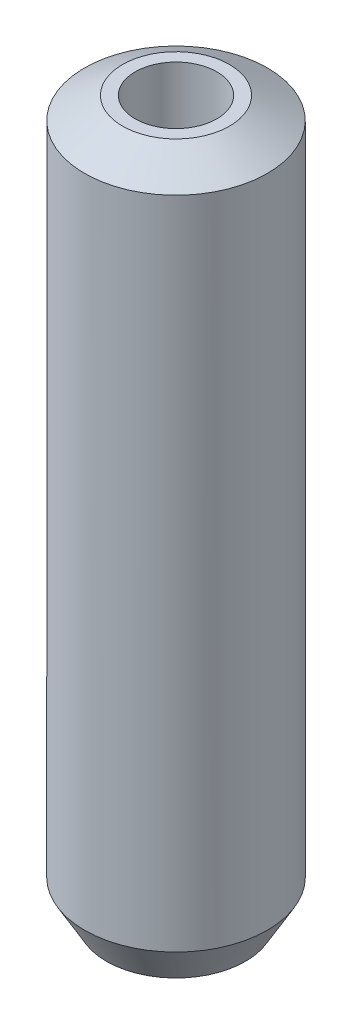
ISO-10303-21;
HEADER;
FILE_DESCRIPTION(('STEP AP214'),'2;1');
FILE_NAME('part.step','',(''),(''),'','','');
FILE_SCHEMA(('AUTOMOTIVE_DESIGN { 1 0 10303 214 1 1 1 1 }'));
ENDSEC;
DATA;
#1=APPLICATION_CONTEXT('core data for automotive mechanical design processes');
#2=APPLICATION_PROTOCOL_DEFINITION('international standard','automotive_design',2000,#1);
#3=PRODUCT_CONTEXT('',#1,'mechanical');
#4=PRODUCT('Part','Part','',(#3));
#5=PRODUCT_RELATED_PRODUCT_CATEGORY('part','',(#4));
#6=PRODUCT_DEFINITION_FORMATION('','',#4);
#7=PRODUCT_DEFINITION_CONTEXT('part definition',#1,'design');
#8=PRODUCT_DEFINITION('design','',#6,#7);
#9=PRODUCT_DEFINITION_SHAPE('','',#8);
#10=(LENGTH_UNIT() NAMED_UNIT(*) SI_UNIT(.MILLI.,.METRE.));
#11=(NAMED_UNIT(*) PLANE_ANGLE_UNIT() SI_UNIT($,.RADIAN.));
#12=(NAMED_UNIT(*) SI_UNIT($,.STERADIAN.) SOLID_ANGLE_UNIT());
#13=UNCERTAINTY_MEASURE_WITH_UNIT(LENGTH_MEASURE(1.E-05),#10,'distance_accuracy_value','');
#14=(GEOMETRIC_REPRESENTATION_CONTEXT(3) GLOBAL_UNCERTAINTY_ASSIGNED_CONTEXT((#13)) GLOBAL_UNIT_ASSIGNED_CONTEXT((#10,
#11,#12)) REPRESENTATION_CONTEXT('',''));
#15=CARTESIAN_POINT('',(0.,0.,0.));
#16=DIRECTION('',(0.,0.,1.));
#17=DIRECTION('',(1.,0.,0.));
#18=AXIS2_PLACEMENT_3D('',#15,#16,#17);
#19=CARTESIAN_POINT('',(0.,117.374975051236,0.));
#20=DIRECTION('',(0.,-1.,0.));
#21=DIRECTION('',(0.,0.,-1.));
#22=AXIS2_PLACEMENT_3D('',#19,#20,#21);
#23=CYLINDRICAL_SURFACE('',#22,15.);
#24=CARTESIAN_POINT('',(0.,113.778539409676,0.));
#25=DIRECTION('',(0.,1.,0.));
#26=DIRECTION('',(0.,0.,1.));
#27=AXIS2_PLACEMENT_3D('',#24,#25,#26);
#28=CIRCLE('',#27,15.);
#29=CARTESIAN_POINT('',(0.,113.778539409676,-15.));
#30=VERTEX_POINT('',#29);
#31=EDGE_CURVE('E50',#30,#30,#28,.F.);
#32=ORIENTED_EDGE('',*,*,#31,.T.);
#33=EDGE_LOOP('',(#32));
#34=FACE_BOUND('',#33,.T.);
#35=CARTESIAN_POINT('',(0.,6.22920925733446,0.));
#36=DIRECTION('',(0.,1.,0.));
#37=DIRECTION('',(0.,0.,1.));
#38=AXIS2_PLACEMENT_3D('',#35,#36,#37);
#39=CIRCLE('',#38,15.);
#40=CARTESIAN_POINT('',(0.,6.22920925733446,15.));
#41=VERTEX_POINT('',#40);
#42=EDGE_CURVE('E51',#41,#41,#39,.T.);
#43=ORIENTED_EDGE('',*,*,#42,.T.);
#44=EDGE_LOOP('',(#43));
#45=FACE_BOUND('',#44,.T.);
#46=ADVANCED_FACE('F39',(#34,#45),#23,.T.);
#47=CARTESIAN_POINT('',(0.,117.374975051236,0.));
#48=DIRECTION('',(0.,1.,0.));
#49=DIRECTION('',(0.,0.,1.));
#50=AXIS2_PLACEMENT_3D('',#47,#48,#49);
#51=PLANE('',#50);
#52=CARTESIAN_POINT('',(0.,117.374975051236,0.));
#53=DIRECTION('',(0.,1.,0.));
#54=DIRECTION('',(0.,0.,1.));
#55=AXIS2_PLACEMENT_3D('',#52,#53,#54);
#56=CIRCLE('',#55,8.77079074266558);
#57=CARTESIAN_POINT('',(0.,117.374975051236,-8.77079074266559));
#58=VERTEX_POINT('',#57);
#59=EDGE_CURVE('E54',#58,#58,#56,.T.);
#60=ORIENTED_EDGE('',*,*,#59,.T.);
#61=EDGE_LOOP('',(#60));
#62=FACE_BOUND('',#61,.T.);
#63=CARTESIAN_POINT('',(0.,117.374975051236,0.));
#64=DIRECTION('',(0.,1.,0.));
#65=DIRECTION('',(0.,0.,1.));
#66=AXIS2_PLACEMENT_3D('',#63,#64,#65);
#67=CIRCLE('',#66,6.69556431701158);
#68=CARTESIAN_POINT('',(0.,117.374975051236,6.69556431701158));
#69=VERTEX_POINT('',#68);
#70=EDGE_CURVE('E58',#69,#69,#67,.T.);
#71=ORIENTED_EDGE('',*,*,#70,.F.);
#72=EDGE_LOOP('',(#71));
#73=FACE_BOUND('',#72,.T.);
#74=ADVANCED_FACE('F69',(#62,#73),#51,.T.);
#75=CARTESIAN_POINT('',(0.,0.,0.));
#76=DIRECTION('',(0.,1.,0.));
#77=DIRECTION('',(0.,0.,1.));
#78=AXIS2_PLACEMENT_3D('',#75,#76,#77);
#79=PLANE('',#78);
#80=CARTESIAN_POINT('',(0.,0.,0.));
#81=DIRECTION('',(0.,1.,0.));
#82=DIRECTION('',(0.,0.,1.));
#83=AXIS2_PLACEMENT_3D('',#80,#81,#82);
#84=CIRCLE('',#83,11.4035643584394);
#85=CARTESIAN_POINT('',(0.,0.,11.4035643584394));
#86=VERTEX_POINT('',#85);
#87=EDGE_CURVE('E10',#86,#86,#84,.F.);
#88=ORIENTED_EDGE('',*,*,#87,.T.);
#89=EDGE_LOOP('',(#88));
#90=FACE_BOUND('',#89,.T.);
#91=CARTESIAN_POINT('',(0.,0.,0.));
#92=DIRECTION('',(0.,1.,0.));
#93=DIRECTION('',(0.,0.,1.));
#94=AXIS2_PLACEMENT_3D('',#91,#92,#93);
#95=CIRCLE('',#94,6.69556431701158);
#96=CARTESIAN_POINT('',(0.,0.,6.69556431701158));
#97=VERTEX_POINT('',#96);
#98=EDGE_CURVE('E63',#97,#97,#95,.T.);
#99=ORIENTED_EDGE('',*,*,#98,.T.);
#100=EDGE_LOOP('',(#99));
#101=FACE_BOUND('',#100,.T.);
#102=ADVANCED_FACE('F75',(#90,#101),#79,.F.);
#103=CARTESIAN_POINT('',(0.,117.374975051236,0.));
#104=DIRECTION('',(0.,-1.,0.));
#105=DIRECTION('',(0.,0.,-1.));
#106=AXIS2_PLACEMENT_3D('',#103,#104,#105);
#107=CYLINDRICAL_SURFACE('',#106,6.69556431701158);
#108=ORIENTED_EDGE('',*,*,#70,.T.);
#109=EDGE_LOOP('',(#108));
#110=FACE_BOUND('',#109,.T.);
#111=ORIENTED_EDGE('',*,*,#98,.F.);
#112=EDGE_LOOP('',(#111));
#113=FACE_BOUND('',#112,.T.);
#114=ADVANCED_FACE('F70',(#110,#113),#107,.F.);
#115=CARTESIAN_POINT('',(0.,117.374975051236,0.));
#116=DIRECTION('',(0.,-1.,0.));
#117=DIRECTION('',(0.,0.,-1.));
#118=AXIS2_PLACEMENT_3D('',#115,#116,#117);
#119=CONICAL_SURFACE('',#118,8.77079074266558,1.04719755119659);
#120=CARTESIAN_POINT('',(0.,113.778539409676,-15.));
#121=CARTESIAN_POINT('',(0.,113.816002280942,-14.9351124035694));
#122=CARTESIAN_POINT('',(0.,113.853465152208,-14.8702248071389));
#123=CARTESIAN_POINT('',(0.,113.928390894741,-14.7404496142777));
#124=CARTESIAN_POINT('',(0.,113.965853766007,-14.6755620178472));
#125=CARTESIAN_POINT('',(0.,114.04077950854,-14.545786824986));
#126=CARTESIAN_POINT('',(0.,114.078242379806,-14.4808992285555));
#127=CARTESIAN_POINT('',(0.,114.153168122338,-14.3511240356943));
#128=CARTESIAN_POINT('',(0.,114.190630993605,-14.2862364392638));
#129=CARTESIAN_POINT('',(0.,114.265556736137,-14.1564612464026));
#130=CARTESIAN_POINT('',(0.,114.303019607403,-14.0915736499721));
#131=CARTESIAN_POINT('',(0.,114.377945349936,-13.9617984571109));
#132=CARTESIAN_POINT('',(0.,114.415408221202,-13.8969108606804));
#133=CARTESIAN_POINT('',(0.,114.490333963735,-13.7671356678192));
#134=CARTESIAN_POINT('',(0.,114.527796835001,-13.7022480713887));
#135=CARTESIAN_POINT('',(0.,114.602722577534,-13.5724728785275));
#136=CARTESIAN_POINT('',(0.,114.6401854488,-13.507585282097));
#137=CARTESIAN_POINT('',(0.,114.715111191332,-13.3778100892358));
#138=CARTESIAN_POINT('',(0.,114.752574062599,-13.3129224928053));
#139=CARTESIAN_POINT('',(0.,114.827499805131,-13.1831472999441));
#140=CARTESIAN_POINT('',(0.,114.864962676397,-13.1182597035136));
#141=CARTESIAN_POINT('',(0.,114.93988841893,-12.9884845106524));
#142=CARTESIAN_POINT('',(0.,114.977351290196,-12.9235969142219));
#143=CARTESIAN_POINT('',(0.,115.052277032729,-12.7938217213607));
#144=CARTESIAN_POINT('',(0.,115.089739903995,-12.7289341249302));
#145=CARTESIAN_POINT('',(0.,115.164665646527,-12.599158932069));
#146=CARTESIAN_POINT('',(0.,115.202128517794,-12.5342713356385));
#147=CARTESIAN_POINT('',(0.,115.277054260326,-12.4044961427773));
#148=CARTESIAN_POINT('',(0.,115.314517131592,-12.3396085463468));
#149=CARTESIAN_POINT('',(0.,115.389442874125,-12.2098333534856));
#150=CARTESIAN_POINT('',(0.,115.426905745391,-12.1449457570551));
#151=CARTESIAN_POINT('',(0.,115.501831487924,-12.0151705641939));
#152=CARTESIAN_POINT('',(0.,115.53929435919,-11.9502829677634));
#153=CARTESIAN_POINT('',(0.,115.614220101722,-11.8205077749022));
#154=CARTESIAN_POINT('',(0.,115.651682972989,-11.7556201784717));
#155=CARTESIAN_POINT('',(0.,115.726608715521,-11.6258449856105));
#156=CARTESIAN_POINT('',(0.,115.764071586787,-11.56095738918));
#157=CARTESIAN_POINT('',(0.,115.83899732932,-11.4311821963188));
#158=CARTESIAN_POINT('',(0.,115.876460200586,-11.3662945998883));
#159=CARTESIAN_POINT('',(0.,115.951385943119,-11.2365194070271));
#160=CARTESIAN_POINT('',(0.,115.988848814385,-11.1716318105966));
#161=CARTESIAN_POINT('',(0.,116.063774556918,-11.0418566177354));
#162=CARTESIAN_POINT('',(0.,116.101237428184,-10.9769690213049));
#163=CARTESIAN_POINT('',(0.,116.176163170716,-10.8471938284437));
#164=CARTESIAN_POINT('',(0.,116.213626041983,-10.7823062320132));
#165=CARTESIAN_POINT('',(0.,116.288551784515,-10.652531039152));
#166=CARTESIAN_POINT('',(0.,116.326014655781,-10.5876434427215));
#167=CARTESIAN_POINT('',(0.,116.400940398314,-10.4578682498603));
#168=CARTESIAN_POINT('',(0.,116.43840326958,-10.3929806534298));
#169=CARTESIAN_POINT('',(0.,116.513329012113,-10.2632054605686));
#170=CARTESIAN_POINT('',(0.,116.550791883379,-10.1983178641381));
#171=CARTESIAN_POINT('',(0.,116.625717625911,-10.0685426712769));
#172=CARTESIAN_POINT('',(0.,116.663180497178,-10.0036550748464));
#173=CARTESIAN_POINT('',(0.,116.73810623971,-9.87387988198523));
#174=CARTESIAN_POINT('',(0.,116.775569110976,-9.80899228555466));
#175=CARTESIAN_POINT('',(0.,116.850494853509,-9.67921709269353));
#176=CARTESIAN_POINT('',(0.,116.887957724775,-9.61432949626296));
#177=CARTESIAN_POINT('',(0.,116.962883467308,-9.48455430340183));
#178=CARTESIAN_POINT('',(0.,117.000346338574,-9.41966670697126));
#179=CARTESIAN_POINT('',(0.,117.075272081106,-9.28989151411013));
#180=CARTESIAN_POINT('',(0.,117.112734952373,-9.22500391767956));
#181=CARTESIAN_POINT('',(0.,117.187660694905,-9.09522872481843));
#182=CARTESIAN_POINT('',(0.,117.225123566171,-9.03034112838786));
#183=CARTESIAN_POINT('',(0.,117.300049308704,-8.90056593552673));
#184=CARTESIAN_POINT('',(0.,117.33751217997,-8.83567833909616));
#185=CARTESIAN_POINT('',(0.,117.374975051236,-8.77079074266559));
#186=B_SPLINE_CURVE_WITH_KNOTS('',3,(#120,#121,#122,#123,#124,#125,#126,#127,#128,#129,#130,
#131,#132,#133,#134,#135,#136,#137,#138,#139,#140,#141,#142,#143,#144,#145,#146,#147,#148,#149,
#150,#151,#152,#153,#154,#155,#156,#157,#158,#159,#160,#161,#162,#163,#164,#165,#166,#167,#168,
#169,#170,#171,#172,#173,#174,#175,#176,#177,#178,#179,#180,#181,#182,#183,#184,#185),
.UNSPECIFIED.,.F.,.F.,(4,2,2,2,2,2,2,2,2,2,2,2,2,2,2,2,2,2,2,2,2,2,2,2,2,2,2,2,2,2,2,2,4),(0.,
0.224777227597541,0.449554455195075,0.674331682792608,0.899108910390141,1.12388613798767,
1.34866336558521,1.57344059318274,1.79821782078027,2.02299504837781,2.24777227597534,
2.47254950357288,2.69732673117041,2.92210395876794,3.14688118636548,3.37165841396301,
3.59643564156054,3.82121286915808,4.04599009675562,4.27076732435315,4.49554455195068,
4.72032177954822,4.94509900714575,5.16987623474328,5.39465346234082,5.61943068993835,
5.84420791753589,6.06898514513342,6.29376237273095,6.51853960032849,6.74331682792602,
6.96809405552355,7.19287128312109),.UNSPECIFIED.);
#187=EDGE_CURVE('BSEAM81',#30,#58,#186,.T.);
#188=ORIENTED_EDGE('',*,*,#31,.F.);
#189=ORIENTED_EDGE('',*,*,#59,.F.);
#190=ORIENTED_EDGE('',*,*,#187,.T.);
#191=ORIENTED_EDGE('',*,*,#187,.F.);
#192=EDGE_LOOP('',(#188,#190,#189,#191));
#193=FACE_BOUND('',#192,.T.);
#194=ADVANCED_FACE('F81',(#193),#119,.T.);
#195=CARTESIAN_POINT('',(0.,6.22920925733446,0.));
#196=DIRECTION('',(0.,1.,0.));
#197=DIRECTION('',(0.,0.,1.));
#198=AXIS2_PLACEMENT_3D('',#195,#196,#197);
#199=CONICAL_SURFACE('',#198,15.,0.523598775598303);
#200=ORIENTED_EDGE('',*,*,#87,.F.);
#201=EDGE_LOOP('',(#200));
#202=FACE_BOUND('',#201,.T.);
#203=ORIENTED_EDGE('',*,*,#42,.F.);
#204=EDGE_LOOP('',(#203));
#205=FACE_BOUND('',#204,.T.);
#206=ADVANCED_FACE('F45',(#202,#205),#199,.T.);
#207=CLOSED_SHELL('',(#46,#74,#102,#114,#194,#206));
#208=MANIFOLD_SOLID_BREP('B2',#207);
#209=ADVANCED_BREP_SHAPE_REPRESENTATION('',(#18,#208),#14);
#210=SHAPE_DEFINITION_REPRESENTATION(#9,#209);
ENDSEC;
END-ISO-10303-21;
